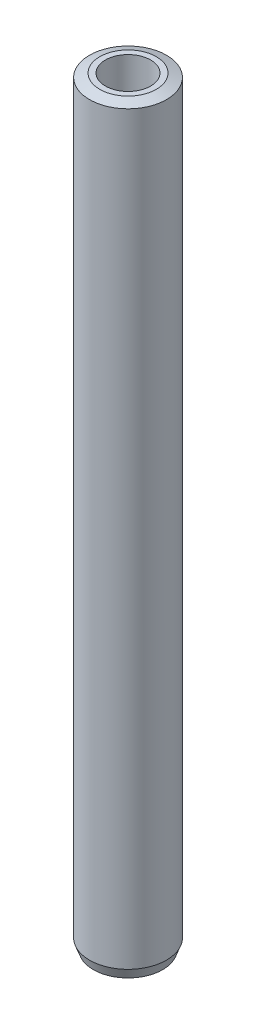
ISO-10303-21;
HEADER;
FILE_DESCRIPTION(('STEP AP214'),'2;1');
FILE_NAME('part.step','',(''),(''),'','','');
FILE_SCHEMA(('AUTOMOTIVE_DESIGN { 1 0 10303 214 1 1 1 1 }'));
ENDSEC;
DATA;
#1=APPLICATION_CONTEXT('core data for automotive mechanical design processes');
#2=APPLICATION_PROTOCOL_DEFINITION('international standard','automotive_design',2000,#1);
#3=PRODUCT_CONTEXT('',#1,'mechanical');
#4=PRODUCT('Part','Part','',(#3));
#5=PRODUCT_RELATED_PRODUCT_CATEGORY('part','',(#4));
#6=PRODUCT_DEFINITION_FORMATION('','',#4);
#7=PRODUCT_DEFINITION_CONTEXT('part definition',#1,'design');
#8=PRODUCT_DEFINITION('design','',#6,#7);
#9=PRODUCT_DEFINITION_SHAPE('','',#8);
#10=(LENGTH_UNIT() NAMED_UNIT(*) SI_UNIT(.MILLI.,.METRE.));
#11=(NAMED_UNIT(*) PLANE_ANGLE_UNIT() SI_UNIT($,.RADIAN.));
#12=(NAMED_UNIT(*) SI_UNIT($,.STERADIAN.) SOLID_ANGLE_UNIT());
#13=UNCERTAINTY_MEASURE_WITH_UNIT(LENGTH_MEASURE(1.E-05),#10,'distance_accuracy_value','');
#14=(GEOMETRIC_REPRESENTATION_CONTEXT(3) GLOBAL_UNCERTAINTY_ASSIGNED_CONTEXT((#13)) GLOBAL_UNIT_ASSIGNED_CONTEXT((#10,
#11,#12)) REPRESENTATION_CONTEXT('',''));
#15=CARTESIAN_POINT('',(0.,0.,0.));
#16=DIRECTION('',(0.,0.,1.));
#17=DIRECTION('',(1.,0.,0.));
#18=AXIS2_PLACEMENT_3D('',#15,#16,#17);
#19=CARTESIAN_POINT('',(0.,443.759268872892,0.));
#20=DIRECTION('',(0.,-1.,0.));
#21=DIRECTION('',(0.,0.,-1.));
#22=AXIS2_PLACEMENT_3D('',#19,#20,#21);
#23=CYLINDRICAL_SURFACE('',#22,22.5);
#24=CARTESIAN_POINT('',(0.,441.539471760509,0.));
#25=DIRECTION('',(0.,1.,0.));
#26=DIRECTION('',(0.,0.,1.));
#27=AXIS2_PLACEMENT_3D('',#24,#25,#26);
#28=CIRCLE('',#27,22.5);
#29=CARTESIAN_POINT('',(0.,441.539471760509,-22.5));
#30=VERTEX_POINT('',#29);
#31=EDGE_CURVE('E50',#30,#30,#28,.F.);
#32=CARTESIAN_POINT('',(0.,5.9615591534557,0.));
#33=DIRECTION('',(0.,1.,0.));
#34=DIRECTION('',(0.,0.,1.));
#35=AXIS2_PLACEMENT_3D('',#32,#33,#34);
#36=CIRCLE('',#35,22.5);
#37=CARTESIAN_POINT('',(0.,5.96155915345564,-22.5));
#38=VERTEX_POINT('',#37);
#39=EDGE_CURVE('E51',#38,#38,#36,.T.);
#40=CARTESIAN_POINT('',(0.,441.539471760509,-22.5));
#41=CARTESIAN_POINT('',(0.,437.002201837519,-22.5));
#42=CARTESIAN_POINT('',(0.,432.464931914529,-22.5));
#43=CARTESIAN_POINT('',(0.,423.390392068548,-22.5));
#44=CARTESIAN_POINT('',(0.,418.853122145558,-22.5));
#45=CARTESIAN_POINT('',(0.,409.778582299578,-22.5));
#46=CARTESIAN_POINT('',(0.,405.241312376588,-22.5));
#47=CARTESIAN_POINT('',(0.,396.166772530607,-22.5));
#48=CARTESIAN_POINT('',(0.,391.629502607617,-22.5));
#49=CARTESIAN_POINT('',(0.,382.554962761637,-22.5));
#50=CARTESIAN_POINT('',(0.,378.017692838647,-22.5));
#51=CARTESIAN_POINT('',(0.,368.943152992667,-22.5));
#52=CARTESIAN_POINT('',(0.,364.405883069677,-22.5));
#53=CARTESIAN_POINT('',(0.,355.331343223696,-22.5));
#54=CARTESIAN_POINT('',(0.,350.794073300706,-22.5));
#55=CARTESIAN_POINT('',(0.,341.719533454726,-22.5));
#56=CARTESIAN_POINT('',(0.,337.182263531736,-22.5));
#57=CARTESIAN_POINT('',(0.,328.107723685755,-22.5));
#58=CARTESIAN_POINT('',(0.,323.570453762765,-22.5));
#59=CARTESIAN_POINT('',(0.,314.495913916785,-22.5));
#60=CARTESIAN_POINT('',(0.,309.958643993795,-22.5));
#61=CARTESIAN_POINT('',(0.,300.884104147815,-22.5));
#62=CARTESIAN_POINT('',(0.,296.346834224824,-22.5));
#63=CARTESIAN_POINT('',(0.,287.272294378844,-22.5));
#64=CARTESIAN_POINT('',(0.,282.735024455854,-22.5));
#65=CARTESIAN_POINT('',(0.,273.660484609874,-22.5));
#66=CARTESIAN_POINT('',(0.,269.123214686884,-22.5));
#67=CARTESIAN_POINT('',(0.,260.048674840903,-22.5));
#68=CARTESIAN_POINT('',(0.,255.511404917913,-22.5));
#69=CARTESIAN_POINT('',(0.,246.436865071933,-22.5));
#70=CARTESIAN_POINT('',(0.,241.899595148943,-22.5));
#71=CARTESIAN_POINT('',(0.,232.825055302963,-22.5));
#72=CARTESIAN_POINT('',(0.,228.287785379972,-22.5));
#73=CARTESIAN_POINT('',(0.,219.213245533992,-22.5));
#74=CARTESIAN_POINT('',(0.,214.675975611002,-22.5));
#75=CARTESIAN_POINT('',(0.,205.601435765022,-22.5));
#76=CARTESIAN_POINT('',(0.,201.064165842032,-22.5));
#77=CARTESIAN_POINT('',(0.,191.989625996051,-22.5));
#78=CARTESIAN_POINT('',(0.,187.452356073061,-22.5));
#79=CARTESIAN_POINT('',(0.,178.377816227081,-22.5));
#80=CARTESIAN_POINT('',(0.,173.840546304091,-22.5));
#81=CARTESIAN_POINT('',(0.,164.76600645811,-22.5));
#82=CARTESIAN_POINT('',(0.,160.22873653512,-22.5));
#83=CARTESIAN_POINT('',(0.,151.15419668914,-22.5));
#84=CARTESIAN_POINT('',(0.,146.61692676615,-22.5));
#85=CARTESIAN_POINT('',(0.,137.54238692017,-22.5));
#86=CARTESIAN_POINT('',(0.,133.005116997179,-22.5));
#87=CARTESIAN_POINT('',(0.,123.930577151199,-22.5));
#88=CARTESIAN_POINT('',(0.,119.393307228209,-22.5));
#89=CARTESIAN_POINT('',(0.,110.318767382229,-22.5));
#90=CARTESIAN_POINT('',(0.,105.781497459239,-22.5));
#91=CARTESIAN_POINT('',(0.,96.7069576132584,-22.5));
#92=CARTESIAN_POINT('',(0.,92.1696876902683,-22.5));
#93=CARTESIAN_POINT('',(0.,83.095147844288,-22.5));
#94=CARTESIAN_POINT('',(0.,78.5578779212979,-22.5));
#95=CARTESIAN_POINT('',(0.,69.4833380753176,-22.5));
#96=CARTESIAN_POINT('',(0.,64.9460681523275,-22.5));
#97=CARTESIAN_POINT('',(0.,55.8715283063472,-22.5));
#98=CARTESIAN_POINT('',(0.,51.334258383357,-22.5));
#99=CARTESIAN_POINT('',(0.,42.2597185373768,-22.5));
#100=CARTESIAN_POINT('',(0.,37.7224486143866,-22.5));
#101=CARTESIAN_POINT('',(0.,28.6479087684063,-22.5));
#102=CARTESIAN_POINT('',(0.,24.1106388454162,-22.5));
#103=CARTESIAN_POINT('',(0.,15.0360989994359,-22.5));
#104=CARTESIAN_POINT('',(0.,10.4988290764458,-22.5));
#105=CARTESIAN_POINT('',(0.,5.96155915345564,-22.5));
#106=B_SPLINE_CURVE_WITH_KNOTS('',3,(#40,#41,#42,#43,#44,#45,#46,#47,#48,#49,#50,#51,#52,#53,
#54,#55,#56,#57,#58,#59,#60,#61,#62,#63,#64,#65,#66,#67,#68,#69,#70,#71,#72,#73,#74,#75,#76,#77,
#78,#79,#80,#81,#82,#83,#84,#85,#86,#87,#88,#89,#90,#91,#92,#93,#94,#95,#96,#97,#98,#99,#100,
#101,#102,#103,#104,#105),.UNSPECIFIED.,.F.,.F.,(4,2,2,2,2,2,2,2,2,2,2,2,2,2,2,2,2,2,2,2,2,2,2,
2,2,2,2,2,2,2,2,2,4),(0.,13.6118097689704,27.2236195379408,40.8354293069112,54.4472390758816,
68.059048844852,81.6708586138224,95.2826683827929,108.894478151763,122.506287920734,
136.118097689704,149.729907458674,163.341717227645,176.953526996615,190.565336765586,
204.177146534556,217.788956303527,231.400766072497,245.012575841467,258.624385610438,
272.236195379408,285.848005148379,299.459814917349,313.071624686319,326.68343445529,
340.29524422426,353.907053993231,367.518863762201,381.130673531172,394.742483300142,
408.354293069112,421.966102838083,435.577912607053),.UNSPECIFIED.);
#107=EDGE_CURVE('BSEAM39',#30,#38,#106,.T.);
#108=ORIENTED_EDGE('',*,*,#31,.T.);
#109=ORIENTED_EDGE('',*,*,#39,.T.);
#110=ORIENTED_EDGE('',*,*,#107,.T.);
#111=ORIENTED_EDGE('',*,*,#107,.F.);
#112=EDGE_LOOP('',(#108,#110,#109,#111));
#113=FACE_BOUND('',#112,.T.);
#114=ADVANCED_FACE('F39',(#113),#23,.T.);
#115=CARTESIAN_POINT('',(0.,443.759268872892,0.));
#116=DIRECTION('',(0.,1.,0.));
#117=DIRECTION('',(0.,0.,1.));
#118=AXIS2_PLACEMENT_3D('',#115,#116,#117);
#119=PLANE('',#118);
#120=CARTESIAN_POINT('',(0.,443.759268872892,0.));
#121=DIRECTION('',(0.,1.,0.));
#122=DIRECTION('',(0.,0.,1.));
#123=AXIS2_PLACEMENT_3D('',#120,#121,#122);
#124=CIRCLE('',#123,16.5384408465464);
#125=CARTESIAN_POINT('',(0.,443.759268872892,16.5384408465464));
#126=VERTEX_POINT('',#125);
#127=EDGE_CURVE('E54',#126,#126,#124,.T.);
#128=ORIENTED_EDGE('',*,*,#127,.T.);
#129=EDGE_LOOP('',(#128));
#130=FACE_BOUND('',#129,.T.);
#131=CARTESIAN_POINT('',(0.,443.759268872892,0.));
#132=DIRECTION('',(0.,1.,0.));
#133=DIRECTION('',(0.,0.,1.));
#134=AXIS2_PLACEMENT_3D('',#131,#132,#133);
#135=CIRCLE('',#134,13.231012936026);
#136=CARTESIAN_POINT('',(0.,443.759268872892,-13.231012936026));
#137=VERTEX_POINT('',#136);
#138=EDGE_CURVE('E58',#137,#137,#135,.T.);
#139=ORIENTED_EDGE('',*,*,#138,.F.);
#140=EDGE_LOOP('',(#139));
#141=FACE_BOUND('',#140,.T.);
#142=ADVANCED_FACE('F69',(#130,#141),#119,.T.);
#143=CARTESIAN_POINT('',(0.,0.,0.));
#144=DIRECTION('',(0.,1.,0.));
#145=DIRECTION('',(0.,0.,1.));
#146=AXIS2_PLACEMENT_3D('',#143,#144,#145);
#147=PLANE('',#146);
#148=CARTESIAN_POINT('',(0.,0.,0.));
#149=DIRECTION('',(0.,1.,0.));
#150=DIRECTION('',(0.,0.,1.));
#151=AXIS2_PLACEMENT_3D('',#148,#149,#150);
#152=CIRCLE('',#151,20.2802028876164);
#153=CARTESIAN_POINT('',(0.,0.,20.2802028876164));
#154=VERTEX_POINT('',#153);
#155=EDGE_CURVE('E10',#154,#154,#152,.F.);
#156=ORIENTED_EDGE('',*,*,#155,.T.);
#157=EDGE_LOOP('',(#156));
#158=FACE_BOUND('',#157,.T.);
#159=CARTESIAN_POINT('',(0.,0.,0.));
#160=DIRECTION('',(0.,1.,0.));
#161=DIRECTION('',(0.,0.,1.));
#162=AXIS2_PLACEMENT_3D('',#159,#160,#161);
#163=CIRCLE('',#162,13.231012936026);
#164=CARTESIAN_POINT('',(0.,0.,-13.231012936026));
#165=VERTEX_POINT('',#164);
#166=EDGE_CURVE('E63',#165,#165,#163,.T.);
#167=ORIENTED_EDGE('',*,*,#166,.T.);
#168=EDGE_LOOP('',(#167));
#169=FACE_BOUND('',#168,.T.);
#170=ADVANCED_FACE('F75',(#158,#169),#147,.F.);
#171=CARTESIAN_POINT('',(0.,443.759268872892,0.));
#172=DIRECTION('',(0.,-1.,0.));
#173=DIRECTION('',(0.,0.,-1.));
#174=AXIS2_PLACEMENT_3D('',#171,#172,#173);
#175=CYLINDRICAL_SURFACE('',#174,13.231012936026);
#176=CARTESIAN_POINT('',(0.,443.759268872892,-13.231012936026));
#177=CARTESIAN_POINT('',(0.,439.136776488799,-13.231012936026));
#178=CARTESIAN_POINT('',(0.,434.514284104706,-13.231012936026));
#179=CARTESIAN_POINT('',(0.,425.269299336521,-13.231012936026));
#180=CARTESIAN_POINT('',(0.,420.646806952429,-13.231012936026));
#181=CARTESIAN_POINT('',(0.,411.401822184243,-13.231012936026));
#182=CARTESIAN_POINT('',(0.,406.779329800151,-13.231012936026));
#183=CARTESIAN_POINT('',(0.,397.534345031965,-13.231012936026));
#184=CARTESIAN_POINT('',(0.,392.911852647873,-13.231012936026));
#185=CARTESIAN_POINT('',(0.,383.666867879688,-13.231012936026));
#186=CARTESIAN_POINT('',(0.,379.044375495595,-13.231012936026));
#187=CARTESIAN_POINT('',(0.,369.79939072741,-13.231012936026));
#188=CARTESIAN_POINT('',(0.,365.176898343317,-13.231012936026));
#189=CARTESIAN_POINT('',(0.,355.931913575132,-13.231012936026));
#190=CARTESIAN_POINT('',(0.,351.309421191039,-13.231012936026));
#191=CARTESIAN_POINT('',(0.,342.064436422854,-13.231012936026));
#192=CARTESIAN_POINT('',(0.,337.441944038761,-13.231012936026));
#193=CARTESIAN_POINT('',(0.,328.196959270576,-13.231012936026));
#194=CARTESIAN_POINT('',(0.,323.574466886483,-13.231012936026));
#195=CARTESIAN_POINT('',(0.,314.329482118298,-13.231012936026));
#196=CARTESIAN_POINT('',(0.,309.706989734206,-13.231012936026));
#197=CARTESIAN_POINT('',(0.,300.46200496602,-13.231012936026));
#198=CARTESIAN_POINT('',(0.,295.839512581928,-13.231012936026));
#199=CARTESIAN_POINT('',(0.,286.594527813743,-13.231012936026));
#200=CARTESIAN_POINT('',(0.,281.97203542965,-13.231012936026));
#201=CARTESIAN_POINT('',(0.,272.727050661465,-13.231012936026));
#202=CARTESIAN_POINT('',(0.,268.104558277372,-13.231012936026));
#203=CARTESIAN_POINT('',(0.,258.859573509187,-13.231012936026));
#204=CARTESIAN_POINT('',(0.,254.237081125094,-13.231012936026));
#205=CARTESIAN_POINT('',(0.,244.992096356909,-13.231012936026));
#206=CARTESIAN_POINT('',(0.,240.369603972816,-13.231012936026));
#207=CARTESIAN_POINT('',(0.,231.124619204631,-13.231012936026));
#208=CARTESIAN_POINT('',(0.,226.502126820538,-13.231012936026));
#209=CARTESIAN_POINT('',(0.,217.257142052353,-13.231012936026));
#210=CARTESIAN_POINT('',(0.,212.634649668261,-13.231012936026));
#211=CARTESIAN_POINT('',(0.,203.389664900075,-13.231012936026));
#212=CARTESIAN_POINT('',(0.,198.767172515983,-13.231012936026));
#213=CARTESIAN_POINT('',(0.,189.522187747797,-13.231012936026));
#214=CARTESIAN_POINT('',(0.,184.899695363705,-13.231012936026));
#215=CARTESIAN_POINT('',(0.,175.65471059552,-13.231012936026));
#216=CARTESIAN_POINT('',(0.,171.032218211427,-13.231012936026));
#217=CARTESIAN_POINT('',(0.,161.787233443242,-13.231012936026));
#218=CARTESIAN_POINT('',(0.,157.164741059149,-13.231012936026));
#219=CARTESIAN_POINT('',(0.,147.919756290964,-13.231012936026));
#220=CARTESIAN_POINT('',(0.,143.297263906871,-13.231012936026));
#221=CARTESIAN_POINT('',(0.,134.052279138686,-13.231012936026));
#222=CARTESIAN_POINT('',(0.,129.429786754593,-13.231012936026));
#223=CARTESIAN_POINT('',(0.,120.184801986408,-13.231012936026));
#224=CARTESIAN_POINT('',(0.,115.562309602316,-13.231012936026));
#225=CARTESIAN_POINT('',(0.,106.31732483413,-13.231012936026));
#226=CARTESIAN_POINT('',(0.,101.694832450038,-13.231012936026));
#227=CARTESIAN_POINT('',(0.,92.4498476818524,-13.231012936026));
#228=CARTESIAN_POINT('',(0.,87.8273552977598,-13.231012936026));
#229=CARTESIAN_POINT('',(0.,78.5823705295746,-13.231012936026));
#230=CARTESIAN_POINT('',(0.,73.9598781454819,-13.231012936026));
#231=CARTESIAN_POINT('',(0.,64.7148933772967,-13.231012936026));
#232=CARTESIAN_POINT('',(0.,60.0924009932041,-13.231012936026));
#233=CARTESIAN_POINT('',(0.,50.8474162250189,-13.231012936026));
#234=CARTESIAN_POINT('',(0.,46.2249238409262,-13.231012936026));
#235=CARTESIAN_POINT('',(0.,36.979939072741,-13.231012936026));
#236=CARTESIAN_POINT('',(0.,32.3574466886484,-13.231012936026));
#237=CARTESIAN_POINT('',(0.,23.1124619204631,-13.231012936026));
#238=CARTESIAN_POINT('',(0.,18.4899695363705,-13.231012936026));
#239=CARTESIAN_POINT('',(0.,9.24498476818525,-13.231012936026));
#240=CARTESIAN_POINT('',(0.,4.62249238409262,-13.231012936026));
#241=CARTESIAN_POINT('',(0.,0.,-13.231012936026));
#242=B_SPLINE_CURVE_WITH_KNOTS('',3,(#176,#177,#178,#179,#180,#181,#182,#183,#184,#185,#186,
#187,#188,#189,#190,#191,#192,#193,#194,#195,#196,#197,#198,#199,#200,#201,#202,#203,#204,#205,
#206,#207,#208,#209,#210,#211,#212,#213,#214,#215,#216,#217,#218,#219,#220,#221,#222,#223,#224,
#225,#226,#227,#228,#229,#230,#231,#232,#233,#234,#235,#236,#237,#238,#239,#240,#241),
.UNSPECIFIED.,.F.,.F.,(4,2,2,2,2,2,2,2,2,2,2,2,2,2,2,2,2,2,2,2,2,2,2,2,2,2,2,2,2,2,2,2,4),(0.,
13.8674771522779,27.7349543045557,41.6024314568336,55.4699086091115,69.3373857613894,
83.2048629136672,97.0723400659451,110.939817218223,124.807294370501,138.674771522779,
152.542248675057,166.409725827334,180.277202979612,194.14468013189,208.012157284168,
221.879634436446,235.747111588724,249.614588741002,263.482065893279,277.349543045557,
291.217020197835,305.084497350113,318.951974502391,332.819451654669,346.686928806947,
360.554405959224,374.421883111502,388.28936026378,402.156837416058,416.024314568336,
429.891791720614,443.759268872892),.UNSPECIFIED.);
#243=EDGE_CURVE('BSEAM70',#137,#165,#242,.T.);
#244=ORIENTED_EDGE('',*,*,#138,.T.);
#245=ORIENTED_EDGE('',*,*,#166,.F.);
#246=ORIENTED_EDGE('',*,*,#243,.T.);
#247=ORIENTED_EDGE('',*,*,#243,.F.);
#248=EDGE_LOOP('',(#244,#246,#245,#247));
#249=FACE_BOUND('',#248,.T.);
#250=ADVANCED_FACE('F70',(#249),#175,.F.);
#251=CARTESIAN_POINT('',(0.,443.759268872892,0.));
#252=DIRECTION('',(0.,-1.,0.));
#253=DIRECTION('',(0.,0.,-1.));
#254=AXIS2_PLACEMENT_3D('',#251,#252,#253);
#255=CONICAL_SURFACE('',#254,16.5384408465464,1.21434940999582);
#256=ORIENTED_EDGE('',*,*,#31,.F.);
#257=EDGE_LOOP('',(#256));
#258=FACE_BOUND('',#257,.T.);
#259=ORIENTED_EDGE('',*,*,#127,.F.);
#260=EDGE_LOOP('',(#259));
#261=FACE_BOUND('',#260,.T.);
#262=ADVANCED_FACE('F81',(#258,#261),#255,.T.);
#263=CARTESIAN_POINT('',(0.,5.9615591534557,0.));
#264=DIRECTION('',(0.,1.,0.));
#265=DIRECTION('',(0.,0.,1.));
#266=AXIS2_PLACEMENT_3D('',#263,#264,#265);
#267=CONICAL_SURFACE('',#266,22.5,0.356446916799081);
#268=ORIENTED_EDGE('',*,*,#155,.F.);
#269=EDGE_LOOP('',(#268));
#270=FACE_BOUND('',#269,.T.);
#271=ORIENTED_EDGE('',*,*,#39,.F.);
#272=EDGE_LOOP('',(#271));
#273=FACE_BOUND('',#272,.T.);
#274=ADVANCED_FACE('F45',(#270,#273),#267,.T.);
#275=CLOSED_SHELL('',(#114,#142,#170,#250,#262,#274));
#276=MANIFOLD_SOLID_BREP('B2',#275);
#277=ADVANCED_BREP_SHAPE_REPRESENTATION('',(#18,#276),#14);
#278=SHAPE_DEFINITION_REPRESENTATION(#9,#277);
ENDSEC;
END-ISO-10303-21;
